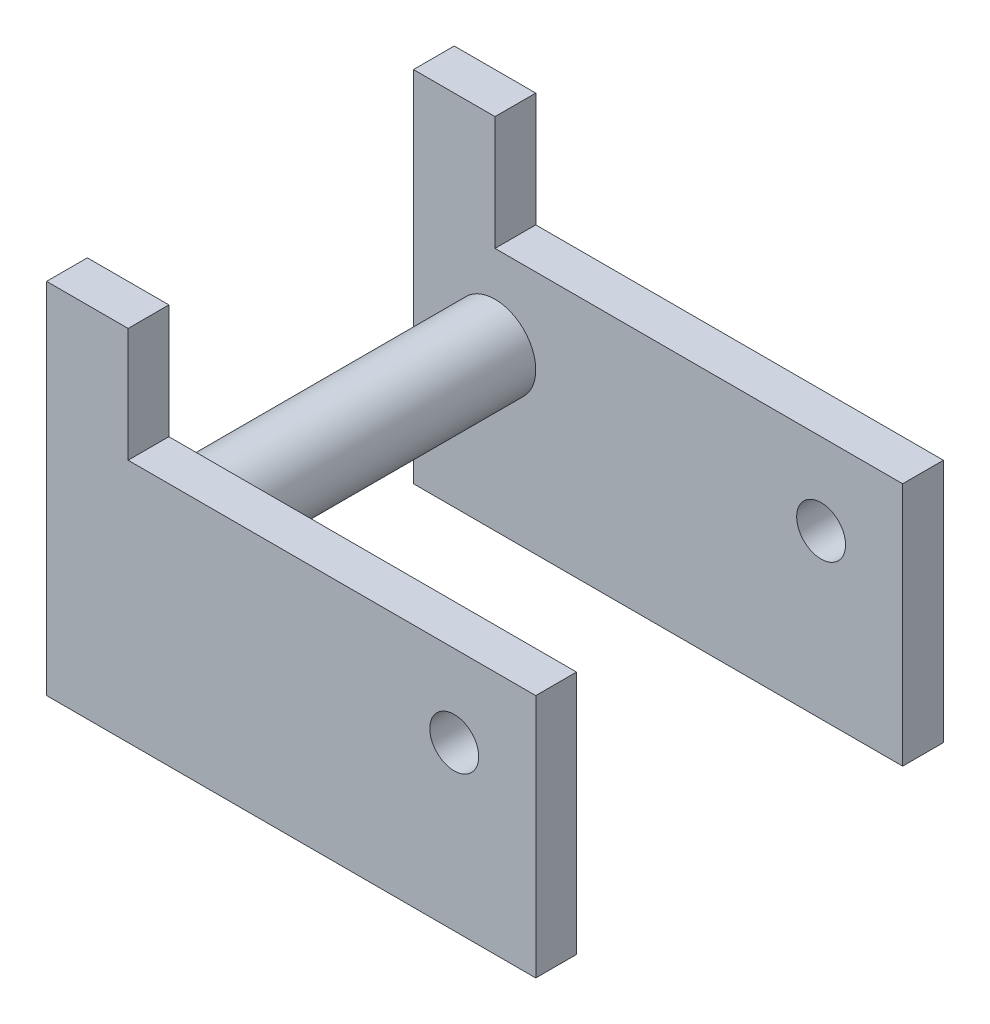
ISO-10303-21;
HEADER;
FILE_DESCRIPTION(('STEP AP214'),'2;1');
FILE_NAME('part.step','',(''),(''),'','','');
FILE_SCHEMA(('AUTOMOTIVE_DESIGN { 1 0 10303 214 1 1 1 1 }'));
ENDSEC;
DATA;
#1=APPLICATION_CONTEXT('core data for automotive mechanical design processes');
#2=APPLICATION_PROTOCOL_DEFINITION('international standard','automotive_design',2000,#1);
#3=PRODUCT_CONTEXT('',#1,'mechanical');
#4=PRODUCT('Part','Part','',(#3));
#5=PRODUCT_RELATED_PRODUCT_CATEGORY('part','',(#4));
#6=PRODUCT_DEFINITION_FORMATION('','',#4);
#7=PRODUCT_DEFINITION_CONTEXT('part definition',#1,'design');
#8=PRODUCT_DEFINITION('design','',#6,#7);
#9=PRODUCT_DEFINITION_SHAPE('','',#8);
#10=(LENGTH_UNIT() NAMED_UNIT(*) SI_UNIT(.MILLI.,.METRE.));
#11=(NAMED_UNIT(*) PLANE_ANGLE_UNIT() SI_UNIT($,.RADIAN.));
#12=(NAMED_UNIT(*) SI_UNIT($,.STERADIAN.) SOLID_ANGLE_UNIT());
#13=UNCERTAINTY_MEASURE_WITH_UNIT(LENGTH_MEASURE(1.E-05),#10,'distance_accuracy_value','');
#14=(GEOMETRIC_REPRESENTATION_CONTEXT(3) GLOBAL_UNCERTAINTY_ASSIGNED_CONTEXT((#13)) GLOBAL_UNIT_ASSIGNED_CONTEXT((#10,
#11,#12)) REPRESENTATION_CONTEXT('',''));
#15=CARTESIAN_POINT('',(0.,0.,0.));
#16=DIRECTION('',(0.,0.,1.));
#17=DIRECTION('',(1.,0.,0.));
#18=AXIS2_PLACEMENT_3D('',#15,#16,#17);
#19=CARTESIAN_POINT('',(0.,0.,31.75));
#20=DIRECTION('',(-1.,0.,0.));
#21=DIRECTION('',(0.,0.,1.));
#22=AXIS2_PLACEMENT_3D('',#19,#20,#21);
#23=PLANE('',#22);
#24=DIRECTION('',(0.,0.,-1.));
#25=VECTOR('',#24,1.);
#26=CARTESIAN_POINT('',(0.,19.05,31.75));
#27=LINE('',#26,#25);
#28=CARTESIAN_POINT('',(0.,19.05,3.175));
#29=VERTEX_POINT('',#28);
#30=CARTESIAN_POINT('',(0.,19.05,0.));
#31=VERTEX_POINT('',#30);
#32=EDGE_CURVE('E103',#29,#31,#27,.T.);
#33=ORIENTED_EDGE('',*,*,#32,.F.);
#34=DIRECTION('',(0.,1.,0.));
#35=VECTOR('',#34,1.);
#36=CARTESIAN_POINT('',(0.,-45.7905011983927,3.175));
#37=LINE('',#36,#35);
#38=CARTESIAN_POINT('',(0.,0.,3.175));
#39=VERTEX_POINT('',#38);
#40=EDGE_CURVE('E51',#39,#29,#37,.T.);
#41=ORIENTED_EDGE('',*,*,#40,.F.);
#42=DIRECTION('',(0.,0.,-1.));
#43=VECTOR('',#42,1.);
#44=CARTESIAN_POINT('',(0.,0.,31.75));
#45=LINE('',#44,#43);
#46=CARTESIAN_POINT('',(0.,0.,0.));
#47=VERTEX_POINT('',#46);
#48=EDGE_CURVE('E123',#39,#47,#45,.T.);
#49=ORIENTED_EDGE('',*,*,#48,.T.);
#50=DIRECTION('',(0.,1.,0.));
#51=VECTOR('',#50,1.);
#52=CARTESIAN_POINT('',(0.,0.,0.));
#53=LINE('',#52,#51);
#54=EDGE_CURVE('E116',#47,#31,#53,.T.);
#55=ORIENTED_EDGE('',*,*,#54,.T.);
#56=EDGE_LOOP('',(#33,#41,#49,#55));
#57=FACE_BOUND('',#56,.T.);
#58=ADVANCED_FACE('F41',(#57),#23,.F.);
#59=CARTESIAN_POINT('',(0.,19.05,31.75));
#60=DIRECTION('',(0.,-1.,0.));
#61=DIRECTION('',(1.,0.,0.));
#62=AXIS2_PLACEMENT_3D('',#59,#60,#61);
#63=PLANE('',#62);
#64=DIRECTION('',(0.,0.,-1.));
#65=VECTOR('',#64,1.);
#66=CARTESIAN_POINT('',(-31.75,19.05,31.75));
#67=LINE('',#66,#65);
#68=CARTESIAN_POINT('',(-31.75,19.05,3.175));
#69=VERTEX_POINT('',#68);
#70=CARTESIAN_POINT('',(-31.75,19.05,0.));
#71=VERTEX_POINT('',#70);
#72=EDGE_CURVE('E98',#69,#71,#67,.T.);
#73=ORIENTED_EDGE('',*,*,#72,.F.);
#74=DIRECTION('',(1.,0.,0.));
#75=VECTOR('',#74,1.);
#76=CARTESIAN_POINT('',(0.,19.05,3.175));
#77=LINE('',#76,#75);
#78=EDGE_CURVE('E59',#69,#29,#77,.T.);
#79=ORIENTED_EDGE('',*,*,#78,.T.);
#80=ORIENTED_EDGE('',*,*,#32,.T.);
#81=DIRECTION('',(-1.,0.,0.));
#82=VECTOR('',#81,1.);
#83=CARTESIAN_POINT('',(0.,19.05,0.));
#84=LINE('',#83,#82);
#85=EDGE_CURVE('E106',#31,#71,#84,.T.);
#86=ORIENTED_EDGE('',*,*,#85,.T.);
#87=EDGE_LOOP('',(#73,#79,#80,#86));
#88=FACE_BOUND('',#87,.T.);
#89=ADVANCED_FACE('F105',(#88),#63,.F.);
#90=CARTESIAN_POINT('',(-31.75,19.05,31.75));
#91=DIRECTION('',(-1.,0.,0.));
#92=DIRECTION('',(0.,0.,1.));
#93=AXIS2_PLACEMENT_3D('',#90,#91,#92);
#94=PLANE('',#93);
#95=DIRECTION('',(0.,0.,-1.));
#96=VECTOR('',#95,1.);
#97=CARTESIAN_POINT('',(-31.75,27.94,31.75));
#98=LINE('',#97,#96);
#99=CARTESIAN_POINT('',(-31.75,27.94,3.175));
#100=VERTEX_POINT('',#99);
#101=CARTESIAN_POINT('',(-31.75,27.94,0.));
#102=VERTEX_POINT('',#101);
#103=EDGE_CURVE('E150',#100,#102,#98,.T.);
#104=ORIENTED_EDGE('',*,*,#103,.F.);
#105=DIRECTION('',(0.,-1.,0.));
#106=VECTOR('',#105,1.);
#107=CARTESIAN_POINT('',(-31.75,19.05,3.175));
#108=LINE('',#107,#106);
#109=EDGE_CURVE('E120',#100,#69,#108,.T.);
#110=ORIENTED_EDGE('',*,*,#109,.T.);
#111=ORIENTED_EDGE('',*,*,#72,.T.);
#112=DIRECTION('',(0.,1.,0.));
#113=VECTOR('',#112,1.);
#114=CARTESIAN_POINT('',(-31.75,19.05,0.));
#115=LINE('',#114,#113);
#116=EDGE_CURVE('E118',#71,#102,#115,.T.);
#117=ORIENTED_EDGE('',*,*,#116,.T.);
#118=EDGE_LOOP('',(#104,#110,#111,#117));
#119=FACE_BOUND('',#118,.T.);
#120=ADVANCED_FACE('F173',(#119),#94,.F.);
#121=CARTESIAN_POINT('',(-38.1,27.94,31.75));
#122=DIRECTION('',(0.,-1.,0.));
#123=DIRECTION('',(0.,0.,-1.));
#124=AXIS2_PLACEMENT_3D('',#121,#122,#123);
#125=PLANE('',#124);
#126=DIRECTION('',(0.,0.,-1.));
#127=VECTOR('',#126,1.);
#128=CARTESIAN_POINT('',(-38.1,27.94,31.75));
#129=LINE('',#128,#127);
#130=CARTESIAN_POINT('',(-38.1,27.94,3.175));
#131=VERTEX_POINT('',#130);
#132=CARTESIAN_POINT('',(-38.1,27.94,0.));
#133=VERTEX_POINT('',#132);
#134=EDGE_CURVE('E140',#131,#133,#129,.T.);
#135=ORIENTED_EDGE('',*,*,#134,.F.);
#136=DIRECTION('',(-1.,0.,0.));
#137=VECTOR('',#136,1.);
#138=CARTESIAN_POINT('',(-38.1,27.94,3.175));
#139=LINE('',#138,#137);
#140=EDGE_CURVE('E142',#100,#131,#139,.T.);
#141=ORIENTED_EDGE('',*,*,#140,.F.);
#142=ORIENTED_EDGE('',*,*,#103,.T.);
#143=DIRECTION('',(-1.,0.,0.));
#144=VECTOR('',#143,1.);
#145=CARTESIAN_POINT('',(-38.1,27.94,0.));
#146=LINE('',#145,#144);
#147=EDGE_CURVE('E141',#102,#133,#146,.T.);
#148=ORIENTED_EDGE('',*,*,#147,.T.);
#149=EDGE_LOOP('',(#135,#141,#142,#148));
#150=FACE_BOUND('',#149,.T.);
#151=ADVANCED_FACE('F176',(#150),#125,.F.);
#152=CARTESIAN_POINT('',(-38.1,0.,31.75));
#153=DIRECTION('',(1.,0.,0.));
#154=DIRECTION('',(0.,0.,-1.));
#155=AXIS2_PLACEMENT_3D('',#152,#153,#154);
#156=PLANE('',#155);
#157=DIRECTION('',(0.,0.,-1.));
#158=VECTOR('',#157,1.);
#159=CARTESIAN_POINT('',(-38.1,0.,31.75));
#160=LINE('',#159,#158);
#161=CARTESIAN_POINT('',(-38.1,0.,3.175));
#162=VERTEX_POINT('',#161);
#163=CARTESIAN_POINT('',(-38.1,0.,0.));
#164=VERTEX_POINT('',#163);
#165=EDGE_CURVE('E156',#162,#164,#160,.T.);
#166=ORIENTED_EDGE('',*,*,#165,.F.);
#167=DIRECTION('',(0.,1.,0.));
#168=VECTOR('',#167,1.);
#169=CARTESIAN_POINT('',(-38.1,-45.7905011983927,3.175));
#170=LINE('',#169,#168);
#171=EDGE_CURVE('E78',#162,#131,#170,.T.);
#172=ORIENTED_EDGE('',*,*,#171,.T.);
#173=ORIENTED_EDGE('',*,*,#134,.T.);
#174=DIRECTION('',(0.,-1.,0.));
#175=VECTOR('',#174,1.);
#176=CARTESIAN_POINT('',(-38.1,0.,0.));
#177=LINE('',#176,#175);
#178=EDGE_CURVE('E155',#133,#164,#177,.T.);
#179=ORIENTED_EDGE('',*,*,#178,.T.);
#180=EDGE_LOOP('',(#166,#172,#173,#179));
#181=FACE_BOUND('',#180,.T.);
#182=ADVANCED_FACE('F179',(#181),#156,.F.);
#183=CARTESIAN_POINT('',(0.,0.,31.75));
#184=DIRECTION('',(0.,1.,0.));
#185=DIRECTION('',(-1.,0.,0.));
#186=AXIS2_PLACEMENT_3D('',#183,#184,#185);
#187=PLANE('',#186);
#188=ORIENTED_EDGE('',*,*,#48,.F.);
#189=DIRECTION('',(1.,0.,0.));
#190=VECTOR('',#189,1.);
#191=CARTESIAN_POINT('',(-38.1,0.,3.175));
#192=LINE('',#191,#190);
#193=EDGE_CURVE('E73',#162,#39,#192,.T.);
#194=ORIENTED_EDGE('',*,*,#193,.F.);
#195=ORIENTED_EDGE('',*,*,#165,.T.);
#196=DIRECTION('',(1.,0.,0.));
#197=VECTOR('',#196,1.);
#198=CARTESIAN_POINT('',(0.,0.,0.));
#199=LINE('',#198,#197);
#200=EDGE_CURVE('E145',#164,#47,#199,.T.);
#201=ORIENTED_EDGE('',*,*,#200,.T.);
#202=EDGE_LOOP('',(#188,#194,#195,#201));
#203=FACE_BOUND('',#202,.T.);
#204=ADVANCED_FACE('F181',(#203),#187,.F.);
#205=CARTESIAN_POINT('',(0.,0.,0.));
#206=DIRECTION('',(0.,0.,1.));
#207=DIRECTION('',(1.,0.,0.));
#208=AXIS2_PLACEMENT_3D('',#205,#206,#207);
#209=PLANE('',#208);
#210=CARTESIAN_POINT('',(-6.35,12.7,0.));
#211=DIRECTION('',(0.,0.,1.));
#212=DIRECTION('',(1.,0.,0.));
#213=AXIS2_PLACEMENT_3D('',#210,#211,#212);
#214=CIRCLE('',#213,1.905);
#215=CARTESIAN_POINT('',(-4.445,12.7,0.));
#216=VERTEX_POINT('',#215);
#217=EDGE_CURVE('E349',#216,#216,#214,.T.);
#218=ORIENTED_EDGE('',*,*,#217,.T.);
#219=EDGE_LOOP('',(#218));
#220=FACE_BOUND('',#219,.T.);
#221=ORIENTED_EDGE('',*,*,#54,.F.);
#222=ORIENTED_EDGE('',*,*,#200,.F.);
#223=ORIENTED_EDGE('',*,*,#178,.F.);
#224=ORIENTED_EDGE('',*,*,#147,.F.);
#225=ORIENTED_EDGE('',*,*,#116,.F.);
#226=ORIENTED_EDGE('',*,*,#85,.F.);
#227=EDGE_LOOP('',(#221,#222,#223,#224,#225,#226));
#228=FACE_BOUND('',#227,.T.);
#229=ADVANCED_FACE('F114',(#220,#228),#209,.F.);
#230=CARTESIAN_POINT('',(-38.1,-45.7905011983927,3.175));
#231=DIRECTION('',(0.,0.,-1.));
#232=DIRECTION('',(-1.,0.,0.));
#233=AXIS2_PLACEMENT_3D('',#230,#231,#232);
#234=PLANE('',#233);
#235=CARTESIAN_POINT('',(-6.35,12.7,3.175));
#236=DIRECTION('',(0.,0.,-1.));
#237=DIRECTION('',(-1.,0.,0.));
#238=AXIS2_PLACEMENT_3D('',#235,#236,#237);
#239=CIRCLE('',#238,1.905);
#240=CARTESIAN_POINT('',(-8.255,12.7,3.175));
#241=VERTEX_POINT('',#240);
#242=EDGE_CURVE('E352',#241,#241,#239,.T.);
#243=ORIENTED_EDGE('',*,*,#242,.T.);
#244=EDGE_LOOP('',(#243));
#245=FACE_BOUND('',#244,.T.);
#246=CARTESIAN_POINT('',(-31.75,12.446,3.175));
#247=DIRECTION('',(0.,0.,-1.));
#248=DIRECTION('',(-1.,0.,0.));
#249=AXIS2_PLACEMENT_3D('',#246,#247,#248);
#250=CIRCLE('',#249,3.175);
#251=CARTESIAN_POINT('',(-34.925,12.446,3.175));
#252=VERTEX_POINT('',#251);
#253=EDGE_CURVE('E11',#252,#252,#250,.F.);
#254=ORIENTED_EDGE('',*,*,#253,.F.);
#255=EDGE_LOOP('',(#254));
#256=FACE_BOUND('',#255,.T.);
#257=ORIENTED_EDGE('',*,*,#109,.F.);
#258=ORIENTED_EDGE('',*,*,#140,.T.);
#259=ORIENTED_EDGE('',*,*,#171,.F.);
#260=ORIENTED_EDGE('',*,*,#193,.T.);
#261=ORIENTED_EDGE('',*,*,#40,.T.);
#262=ORIENTED_EDGE('',*,*,#78,.F.);
#263=EDGE_LOOP('',(#257,#258,#259,#260,#261,#262));
#264=FACE_BOUND('',#263,.T.);
#265=ADVANCED_FACE('F178',(#245,#256,#264),#234,.F.);
#266=CARTESIAN_POINT('',(-31.75,12.446,37.5552561210692));
#267=DIRECTION('',(0.,0.,-1.));
#268=DIRECTION('',(-1.,0.,0.));
#269=AXIS2_PLACEMENT_3D('',#266,#267,#268);
#270=CYLINDRICAL_SURFACE('',#269,3.175);
#271=ORIENTED_EDGE('',*,*,#253,.T.);
#272=EDGE_LOOP('',(#271));
#273=FACE_BOUND('',#272,.T.);
#274=CARTESIAN_POINT('',(-31.75,12.446,28.575));
#275=DIRECTION('',(0.,0.,1.));
#276=DIRECTION('',(1.,0.,0.));
#277=AXIS2_PLACEMENT_3D('',#274,#275,#276);
#278=CIRCLE('',#277,3.175);
#279=CARTESIAN_POINT('',(-28.575,12.446,28.575));
#280=VERTEX_POINT('',#279);
#281=EDGE_CURVE('E130',#280,#280,#278,.T.);
#282=ORIENTED_EDGE('',*,*,#281,.F.);
#283=EDGE_LOOP('',(#282));
#284=FACE_BOUND('',#283,.T.);
#285=ADVANCED_FACE('F221',(#273,#284),#270,.T.);
#286=CARTESIAN_POINT('',(0.,0.,31.75));
#287=DIRECTION('',(0.,0.,1.));
#288=DIRECTION('',(1.,0.,0.));
#289=AXIS2_PLACEMENT_3D('',#286,#287,#288);
#290=PLANE('',#289);
#291=CARTESIAN_POINT('',(-6.35,12.7,31.75));
#292=DIRECTION('',(0.,0.,1.));
#293=DIRECTION('',(1.,0.,0.));
#294=AXIS2_PLACEMENT_3D('',#291,#292,#293);
#295=CIRCLE('',#294,1.905);
#296=CARTESIAN_POINT('',(-4.445,12.7,31.75));
#297=VERTEX_POINT('',#296);
#298=EDGE_CURVE('E363',#297,#297,#295,.T.);
#299=ORIENTED_EDGE('',*,*,#298,.F.);
#300=EDGE_LOOP('',(#299));
#301=FACE_BOUND('',#300,.T.);
#302=DIRECTION('',(0.,1.,0.));
#303=VECTOR('',#302,1.);
#304=CARTESIAN_POINT('',(0.,0.,31.75));
#305=LINE('',#304,#303);
#306=CARTESIAN_POINT('',(0.,0.,31.75));
#307=VERTEX_POINT('',#306);
#308=CARTESIAN_POINT('',(0.,19.05,31.75));
#309=VERTEX_POINT('',#308);
#310=EDGE_CURVE('E385',#307,#309,#305,.T.);
#311=ORIENTED_EDGE('',*,*,#310,.T.);
#312=DIRECTION('',(-1.,0.,0.));
#313=VECTOR('',#312,1.);
#314=CARTESIAN_POINT('',(0.,19.05,31.75));
#315=LINE('',#314,#313);
#316=CARTESIAN_POINT('',(-31.75,19.05,31.75));
#317=VERTEX_POINT('',#316);
#318=EDGE_CURVE('E389',#309,#317,#315,.T.);
#319=ORIENTED_EDGE('',*,*,#318,.T.);
#320=DIRECTION('',(0.,1.,0.));
#321=VECTOR('',#320,1.);
#322=CARTESIAN_POINT('',(-31.75,19.05,31.75));
#323=LINE('',#322,#321);
#324=CARTESIAN_POINT('',(-31.75,27.94,31.75));
#325=VERTEX_POINT('',#324);
#326=EDGE_CURVE('E393',#317,#325,#323,.T.);
#327=ORIENTED_EDGE('',*,*,#326,.T.);
#328=DIRECTION('',(-1.,0.,0.));
#329=VECTOR('',#328,1.);
#330=CARTESIAN_POINT('',(-38.1,27.94,31.75));
#331=LINE('',#330,#329);
#332=CARTESIAN_POINT('',(-38.1,27.94,31.75));
#333=VERTEX_POINT('',#332);
#334=EDGE_CURVE('E397',#325,#333,#331,.T.);
#335=ORIENTED_EDGE('',*,*,#334,.T.);
#336=DIRECTION('',(0.,-1.,0.));
#337=VECTOR('',#336,1.);
#338=CARTESIAN_POINT('',(-38.1,6.34999999999999,31.75));
#339=LINE('',#338,#337);
#340=CARTESIAN_POINT('',(-38.1,0.,31.75));
#341=VERTEX_POINT('',#340);
#342=EDGE_CURVE('E401',#333,#341,#339,.T.);
#343=ORIENTED_EDGE('',*,*,#342,.T.);
#344=DIRECTION('',(1.,0.,0.));
#345=VECTOR('',#344,1.);
#346=CARTESIAN_POINT('',(0.,0.,31.75));
#347=LINE('',#346,#345);
#348=EDGE_CURVE('E405',#341,#307,#347,.T.);
#349=ORIENTED_EDGE('',*,*,#348,.T.);
#350=EDGE_LOOP('',(#311,#319,#327,#335,#343,#349));
#351=FACE_BOUND('',#350,.T.);
#352=ADVANCED_FACE('F226',(#301,#351),#290,.T.);
#353=CARTESIAN_POINT('',(0.,0.,31.75));
#354=DIRECTION('',(0.,1.,0.));
#355=DIRECTION('',(-1.,0.,0.));
#356=AXIS2_PLACEMENT_3D('',#353,#354,#355);
#357=PLANE('',#356);
#358=DIRECTION('',(0.,0.,-1.));
#359=VECTOR('',#358,1.);
#360=CARTESIAN_POINT('',(-38.1,0.,31.75));
#361=LINE('',#360,#359);
#362=CARTESIAN_POINT('',(-38.1,0.,28.575));
#363=VERTEX_POINT('',#362);
#364=EDGE_CURVE('E413',#341,#363,#361,.T.);
#365=ORIENTED_EDGE('',*,*,#364,.T.);
#366=DIRECTION('',(-1.,0.,0.));
#367=VECTOR('',#366,1.);
#368=CARTESIAN_POINT('',(-38.1,0.,28.575));
#369=LINE('',#368,#367);
#370=CARTESIAN_POINT('',(0.,0.,28.575));
#371=VERTEX_POINT('',#370);
#372=EDGE_CURVE('E370',#371,#363,#369,.T.);
#373=ORIENTED_EDGE('',*,*,#372,.F.);
#374=DIRECTION('',(0.,0.,-1.));
#375=VECTOR('',#374,1.);
#376=CARTESIAN_POINT('',(0.,0.,31.75));
#377=LINE('',#376,#375);
#378=EDGE_CURVE('E409',#307,#371,#377,.T.);
#379=ORIENTED_EDGE('',*,*,#378,.F.);
#380=ORIENTED_EDGE('',*,*,#348,.F.);
#381=EDGE_LOOP('',(#365,#373,#379,#380));
#382=FACE_BOUND('',#381,.T.);
#383=ADVANCED_FACE('F236',(#382),#357,.F.);
#384=CARTESIAN_POINT('',(-38.1,0.,31.75));
#385=DIRECTION('',(1.,0.,0.));
#386=DIRECTION('',(0.,0.,-1.));
#387=AXIS2_PLACEMENT_3D('',#384,#385,#386);
#388=PLANE('',#387);
#389=DIRECTION('',(0.,0.,-1.));
#390=VECTOR('',#389,1.);
#391=CARTESIAN_POINT('',(-38.1,27.94,31.75));
#392=LINE('',#391,#390);
#393=CARTESIAN_POINT('',(-38.1,27.94,28.575));
#394=VERTEX_POINT('',#393);
#395=EDGE_CURVE('E417',#333,#394,#392,.T.);
#396=ORIENTED_EDGE('',*,*,#395,.T.);
#397=DIRECTION('',(0.,1.,0.));
#398=VECTOR('',#397,1.);
#399=CARTESIAN_POINT('',(-38.1,-45.7905011983927,28.575));
#400=LINE('',#399,#398);
#401=EDGE_CURVE('E359',#363,#394,#400,.T.);
#402=ORIENTED_EDGE('',*,*,#401,.F.);
#403=ORIENTED_EDGE('',*,*,#364,.F.);
#404=ORIENTED_EDGE('',*,*,#342,.F.);
#405=EDGE_LOOP('',(#396,#402,#403,#404));
#406=FACE_BOUND('',#405,.T.);
#407=ADVANCED_FACE('F241',(#406),#388,.F.);
#408=CARTESIAN_POINT('',(-38.1,27.94,31.75));
#409=DIRECTION('',(0.,-1.,0.));
#410=DIRECTION('',(0.,0.,-1.));
#411=AXIS2_PLACEMENT_3D('',#408,#409,#410);
#412=PLANE('',#411);
#413=DIRECTION('',(0.,0.,-1.));
#414=VECTOR('',#413,1.);
#415=CARTESIAN_POINT('',(-31.75,27.94,31.75));
#416=LINE('',#415,#414);
#417=CARTESIAN_POINT('',(-31.75,27.94,28.575));
#418=VERTEX_POINT('',#417);
#419=EDGE_CURVE('E421',#325,#418,#416,.T.);
#420=ORIENTED_EDGE('',*,*,#419,.T.);
#421=DIRECTION('',(1.,0.,0.));
#422=VECTOR('',#421,1.);
#423=CARTESIAN_POINT('',(-38.1,27.94,28.575));
#424=LINE('',#423,#422);
#425=EDGE_CURVE('E354',#394,#418,#424,.T.);
#426=ORIENTED_EDGE('',*,*,#425,.F.);
#427=ORIENTED_EDGE('',*,*,#395,.F.);
#428=ORIENTED_EDGE('',*,*,#334,.F.);
#429=EDGE_LOOP('',(#420,#426,#427,#428));
#430=FACE_BOUND('',#429,.T.);
#431=ADVANCED_FACE('F252',(#430),#412,.F.);
#432=CARTESIAN_POINT('',(-31.75,19.05,31.75));
#433=DIRECTION('',(-1.,0.,0.));
#434=DIRECTION('',(0.,0.,1.));
#435=AXIS2_PLACEMENT_3D('',#432,#433,#434);
#436=PLANE('',#435);
#437=DIRECTION('',(0.,0.,-1.));
#438=VECTOR('',#437,1.);
#439=CARTESIAN_POINT('',(-31.75,19.05,31.75));
#440=LINE('',#439,#438);
#441=CARTESIAN_POINT('',(-31.75,19.05,28.575));
#442=VERTEX_POINT('',#441);
#443=EDGE_CURVE('E425',#317,#442,#440,.T.);
#444=ORIENTED_EDGE('',*,*,#443,.T.);
#445=DIRECTION('',(0.,1.,0.));
#446=VECTOR('',#445,1.);
#447=CARTESIAN_POINT('',(-31.75,19.05,28.575));
#448=LINE('',#447,#446);
#449=EDGE_CURVE('E377',#442,#418,#448,.T.);
#450=ORIENTED_EDGE('',*,*,#449,.T.);
#451=ORIENTED_EDGE('',*,*,#419,.F.);
#452=ORIENTED_EDGE('',*,*,#326,.F.);
#453=EDGE_LOOP('',(#444,#450,#451,#452));
#454=FACE_BOUND('',#453,.T.);
#455=ADVANCED_FACE('F263',(#454),#436,.F.);
#456=CARTESIAN_POINT('',(0.,19.05,31.75));
#457=DIRECTION('',(0.,-1.,0.));
#458=DIRECTION('',(1.,0.,0.));
#459=AXIS2_PLACEMENT_3D('',#456,#457,#458);
#460=PLANE('',#459);
#461=DIRECTION('',(0.,0.,-1.));
#462=VECTOR('',#461,1.);
#463=CARTESIAN_POINT('',(0.,19.05,31.75));
#464=LINE('',#463,#462);
#465=CARTESIAN_POINT('',(0.,19.05,28.575));
#466=VERTEX_POINT('',#465);
#467=EDGE_CURVE('E429',#309,#466,#464,.T.);
#468=ORIENTED_EDGE('',*,*,#467,.T.);
#469=DIRECTION('',(-1.,0.,0.));
#470=VECTOR('',#469,1.);
#471=CARTESIAN_POINT('',(0.,19.05,28.575));
#472=LINE('',#471,#470);
#473=EDGE_CURVE('E381',#466,#442,#472,.T.);
#474=ORIENTED_EDGE('',*,*,#473,.T.);
#475=ORIENTED_EDGE('',*,*,#443,.F.);
#476=ORIENTED_EDGE('',*,*,#318,.F.);
#477=EDGE_LOOP('',(#468,#474,#475,#476));
#478=FACE_BOUND('',#477,.T.);
#479=ADVANCED_FACE('F273',(#478),#460,.F.);
#480=CARTESIAN_POINT('',(0.,0.,31.75));
#481=DIRECTION('',(-1.,0.,0.));
#482=DIRECTION('',(0.,0.,1.));
#483=AXIS2_PLACEMENT_3D('',#480,#481,#482);
#484=PLANE('',#483);
#485=ORIENTED_EDGE('',*,*,#378,.T.);
#486=DIRECTION('',(0.,1.,0.));
#487=VECTOR('',#486,1.);
#488=CARTESIAN_POINT('',(0.,-45.7905011983927,28.575));
#489=LINE('',#488,#487);
#490=EDGE_CURVE('E366',#371,#466,#489,.T.);
#491=ORIENTED_EDGE('',*,*,#490,.T.);
#492=ORIENTED_EDGE('',*,*,#467,.F.);
#493=ORIENTED_EDGE('',*,*,#310,.F.);
#494=EDGE_LOOP('',(#485,#491,#492,#493));
#495=FACE_BOUND('',#494,.T.);
#496=ADVANCED_FACE('F283',(#495),#484,.F.);
#497=CARTESIAN_POINT('',(-38.1,-45.7905011983927,28.575));
#498=DIRECTION('',(0.,0.,1.));
#499=DIRECTION('',(1.,0.,0.));
#500=AXIS2_PLACEMENT_3D('',#497,#498,#499);
#501=PLANE('',#500);
#502=CARTESIAN_POINT('',(-6.35,12.7,28.575));
#503=DIRECTION('',(0.,0.,1.));
#504=DIRECTION('',(1.,0.,0.));
#505=AXIS2_PLACEMENT_3D('',#502,#503,#504);
#506=CIRCLE('',#505,1.905);
#507=CARTESIAN_POINT('',(-4.445,12.7,28.575));
#508=VERTEX_POINT('',#507);
#509=EDGE_CURVE('E44',#508,#508,#506,.T.);
#510=ORIENTED_EDGE('',*,*,#509,.T.);
#511=EDGE_LOOP('',(#510));
#512=FACE_BOUND('',#511,.T.);
#513=ORIENTED_EDGE('',*,*,#281,.T.);
#514=EDGE_LOOP('',(#513));
#515=FACE_BOUND('',#514,.T.);
#516=ORIENTED_EDGE('',*,*,#490,.F.);
#517=ORIENTED_EDGE('',*,*,#372,.T.);
#518=ORIENTED_EDGE('',*,*,#401,.T.);
#519=ORIENTED_EDGE('',*,*,#425,.T.);
#520=ORIENTED_EDGE('',*,*,#449,.F.);
#521=ORIENTED_EDGE('',*,*,#473,.F.);
#522=EDGE_LOOP('',(#516,#517,#518,#519,#520,#521));
#523=FACE_BOUND('',#522,.T.);
#524=ADVANCED_FACE('F293',(#512,#515,#523),#501,.F.);
#525=CARTESIAN_POINT('',(-6.35,12.7,0.));
#526=DIRECTION('',(0.,0.,1.));
#527=DIRECTION('',(1.,0.,0.));
#528=AXIS2_PLACEMENT_3D('',#525,#526,#527);
#529=CYLINDRICAL_SURFACE('',#528,1.905);
#530=ORIENTED_EDGE('',*,*,#298,.T.);
#531=EDGE_LOOP('',(#530));
#532=FACE_BOUND('',#531,.T.);
#533=ORIENTED_EDGE('',*,*,#509,.F.);
#534=EDGE_LOOP('',(#533));
#535=FACE_BOUND('',#534,.T.);
#536=ADVANCED_FACE('F324',(#532,#535),#529,.F.);
#537=ORIENTED_EDGE('',*,*,#217,.F.);
#538=EDGE_LOOP('',(#537));
#539=FACE_BOUND('',#538,.T.);
#540=ORIENTED_EDGE('',*,*,#242,.F.);
#541=EDGE_LOOP('',(#540));
#542=FACE_BOUND('',#541,.T.);
#543=ADVANCED_FACE('F333',(#539,#542),#529,.F.);
#544=CLOSED_SHELL('',(#58,#89,#120,#151,#182,#204,#229,#265,#285,#352,#383,#407,#431,#455,#479,
#496,#524,#536,#543));
#545=MANIFOLD_SOLID_BREP('B2',#544);
#546=ADVANCED_BREP_SHAPE_REPRESENTATION('',(#18,#545),#14);
#547=SHAPE_DEFINITION_REPRESENTATION(#9,#546);
ENDSEC;
END-ISO-10303-21;
